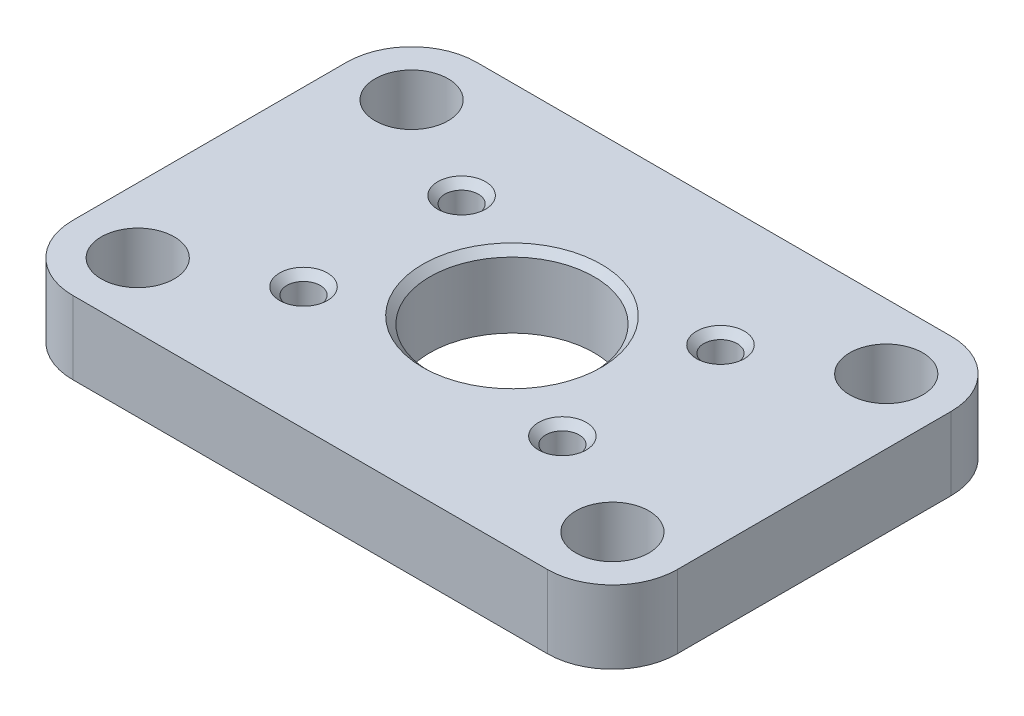
ISO-10303-21;
HEADER;
FILE_DESCRIPTION(('STEP AP214'),'2;1');
FILE_NAME('part.step','',(''),(''),'','','');
FILE_SCHEMA(('AUTOMOTIVE_DESIGN { 1 0 10303 214 1 1 1 1 }'));
ENDSEC;
DATA;
#1=APPLICATION_CONTEXT('core data for automotive mechanical design processes');
#2=APPLICATION_PROTOCOL_DEFINITION('international standard','automotive_design',2000,#1);
#3=PRODUCT_CONTEXT('',#1,'mechanical');
#4=PRODUCT('Part','Part','',(#3));
#5=PRODUCT_RELATED_PRODUCT_CATEGORY('part','',(#4));
#6=PRODUCT_DEFINITION_FORMATION('','',#4);
#7=PRODUCT_DEFINITION_CONTEXT('part definition',#1,'design');
#8=PRODUCT_DEFINITION('design','',#6,#7);
#9=PRODUCT_DEFINITION_SHAPE('','',#8);
#10=(LENGTH_UNIT() NAMED_UNIT(*) SI_UNIT(.MILLI.,.METRE.));
#11=(NAMED_UNIT(*) PLANE_ANGLE_UNIT() SI_UNIT($,.RADIAN.));
#12=(NAMED_UNIT(*) SI_UNIT($,.STERADIAN.) SOLID_ANGLE_UNIT());
#13=UNCERTAINTY_MEASURE_WITH_UNIT(LENGTH_MEASURE(1.E-05),#10,'distance_accuracy_value','');
#14=(GEOMETRIC_REPRESENTATION_CONTEXT(3) GLOBAL_UNCERTAINTY_ASSIGNED_CONTEXT((#13)) GLOBAL_UNIT_ASSIGNED_CONTEXT((#10,
#11,#12)) REPRESENTATION_CONTEXT('',''));
#15=CARTESIAN_POINT('',(0.,0.,0.));
#16=DIRECTION('',(0.,0.,1.));
#17=DIRECTION('',(1.,0.,0.));
#18=AXIS2_PLACEMENT_3D('',#15,#16,#17);
#19=CARTESIAN_POINT('',(16.51,5.08,9.525));
#20=DIRECTION('',(0.,1.,0.));
#21=DIRECTION('',(0.,0.,1.));
#22=AXIS2_PLACEMENT_3D('',#19,#20,#21);
#23=PLANE('',#22);
#24=CARTESIAN_POINT('',(0.,5.08,0.));
#25=DIRECTION('',(0.,1.,0.));
#26=DIRECTION('',(0.,0.,1.));
#27=AXIS2_PLACEMENT_3D('',#24,#25,#26);
#28=CIRCLE('',#27,6.215);
#29=CARTESIAN_POINT('',(0.,5.08,6.215));
#30=VERTEX_POINT('',#29);
#31=EDGE_CURVE('E187',#30,#30,#28,.F.);
#32=ORIENTED_EDGE('',*,*,#31,.T.);
#33=EDGE_LOOP('',(#32));
#34=FACE_BOUND('',#33,.T.);
#35=CARTESIAN_POINT('',(-9.0043,5.08,5.4991));
#36=DIRECTION('',(0.,1.,0.));
#37=DIRECTION('',(0.,0.,1.));
#38=AXIS2_PLACEMENT_3D('',#35,#36,#37);
#39=CIRCLE('',#38,1.66205000000001);
#40=CARTESIAN_POINT('',(-9.0043,5.08,7.16115));
#41=VERTEX_POINT('',#40);
#42=EDGE_CURVE('E184',#41,#41,#39,.F.);
#43=ORIENTED_EDGE('',*,*,#42,.T.);
#44=EDGE_LOOP('',(#43));
#45=FACE_BOUND('',#44,.T.);
#46=CARTESIAN_POINT('',(9.0043,5.08,5.4991));
#47=DIRECTION('',(0.,1.,0.));
#48=DIRECTION('',(0.,0.,1.));
#49=AXIS2_PLACEMENT_3D('',#46,#47,#48);
#50=CIRCLE('',#49,1.66205000000001);
#51=CARTESIAN_POINT('',(9.0043,5.08,7.16115));
#52=VERTEX_POINT('',#51);
#53=EDGE_CURVE('E181',#52,#52,#50,.F.);
#54=ORIENTED_EDGE('',*,*,#53,.T.);
#55=EDGE_LOOP('',(#54));
#56=FACE_BOUND('',#55,.T.);
#57=CARTESIAN_POINT('',(9.0043,5.08,-5.4991));
#58=DIRECTION('',(0.,1.,0.));
#59=DIRECTION('',(0.,0.,1.));
#60=AXIS2_PLACEMENT_3D('',#57,#58,#59);
#61=CIRCLE('',#60,1.66205000000001);
#62=CARTESIAN_POINT('',(9.0043,5.08,-3.83705));
#63=VERTEX_POINT('',#62);
#64=EDGE_CURVE('E178',#63,#63,#61,.F.);
#65=ORIENTED_EDGE('',*,*,#64,.T.);
#66=EDGE_LOOP('',(#65));
#67=FACE_BOUND('',#66,.T.);
#68=CARTESIAN_POINT('',(-9.0043,5.08,-5.4991));
#69=DIRECTION('',(0.,1.,0.));
#70=DIRECTION('',(0.,0.,1.));
#71=AXIS2_PLACEMENT_3D('',#68,#69,#70);
#72=CIRCLE('',#71,1.66205000000001);
#73=CARTESIAN_POINT('',(-9.0043,5.08,-3.83705));
#74=VERTEX_POINT('',#73);
#75=EDGE_CURVE('E175',#74,#74,#72,.F.);
#76=ORIENTED_EDGE('',*,*,#75,.T.);
#77=EDGE_LOOP('',(#76));
#78=FACE_BOUND('',#77,.T.);
#79=CARTESIAN_POINT('',(16.51,5.08,9.525));
#80=DIRECTION('',(0.,1.,0.));
#81=DIRECTION('',(0.,0.,1.));
#82=AXIS2_PLACEMENT_3D('',#79,#80,#81);
#83=CIRCLE('',#82,2.54);
#84=CARTESIAN_POINT('',(16.51,5.08,12.065));
#85=VERTEX_POINT('',#84);
#86=EDGE_CURVE('E310',#85,#85,#83,.T.);
#87=ORIENTED_EDGE('',*,*,#86,.F.);
#88=EDGE_LOOP('',(#87));
#89=FACE_BOUND('',#88,.T.);
#90=CARTESIAN_POINT('',(-16.51,5.08,9.525));
#91=DIRECTION('',(0.,1.,0.));
#92=DIRECTION('',(0.,0.,1.));
#93=AXIS2_PLACEMENT_3D('',#90,#91,#92);
#94=CIRCLE('',#93,2.54);
#95=CARTESIAN_POINT('',(-16.51,5.08,12.065));
#96=VERTEX_POINT('',#95);
#97=EDGE_CURVE('E146',#96,#96,#94,.T.);
#98=ORIENTED_EDGE('',*,*,#97,.F.);
#99=EDGE_LOOP('',(#98));
#100=FACE_BOUND('',#99,.T.);
#101=CARTESIAN_POINT('',(16.51,5.08,9.525));
#102=DIRECTION('',(0.,1.,0.));
#103=DIRECTION('',(0.,0.,1.));
#104=AXIS2_PLACEMENT_3D('',#101,#102,#103);
#105=CIRCLE('',#104,4.5212);
#106=CARTESIAN_POINT('',(16.51,5.08,14.0462));
#107=VERTEX_POINT('',#106);
#108=CARTESIAN_POINT('',(21.0312,5.08,9.525));
#109=VERTEX_POINT('',#108);
#110=EDGE_CURVE('E157',#107,#109,#105,.T.);
#111=ORIENTED_EDGE('',*,*,#110,.T.);
#112=DIRECTION('',(0.,0.,-1.));
#113=VECTOR('',#112,1.);
#114=CARTESIAN_POINT('',(21.0312,5.08,9.525));
#115=LINE('',#114,#113);
#116=CARTESIAN_POINT('',(21.0312,5.08,-9.525));
#117=VERTEX_POINT('',#116);
#118=EDGE_CURVE('E105',#109,#117,#115,.T.);
#119=ORIENTED_EDGE('',*,*,#118,.T.);
#120=CARTESIAN_POINT('',(16.51,5.08,-9.525));
#121=DIRECTION('',(0.,1.,0.));
#122=DIRECTION('',(0.,0.,-1.));
#123=AXIS2_PLACEMENT_3D('',#120,#121,#122);
#124=CIRCLE('',#123,4.5212);
#125=CARTESIAN_POINT('',(16.51,5.08,-14.0462));
#126=VERTEX_POINT('',#125);
#127=EDGE_CURVE('E328',#117,#126,#124,.T.);
#128=ORIENTED_EDGE('',*,*,#127,.T.);
#129=DIRECTION('',(-1.,0.,0.));
#130=VECTOR('',#129,1.);
#131=CARTESIAN_POINT('',(-16.51,5.08,-14.0462));
#132=LINE('',#131,#130);
#133=CARTESIAN_POINT('',(-16.51,5.08,-14.0462));
#134=VERTEX_POINT('',#133);
#135=EDGE_CURVE('E330',#126,#134,#132,.T.);
#136=ORIENTED_EDGE('',*,*,#135,.T.);
#137=CARTESIAN_POINT('',(-16.51,5.08,-9.52499999999999));
#138=DIRECTION('',(0.,1.,0.));
#139=DIRECTION('',(0.,0.,-1.));
#140=AXIS2_PLACEMENT_3D('',#137,#138,#139);
#141=CIRCLE('',#140,4.5212);
#142=CARTESIAN_POINT('',(-21.0312,5.08,-9.52499999999999));
#143=VERTEX_POINT('',#142);
#144=EDGE_CURVE('E124',#134,#143,#141,.T.);
#145=ORIENTED_EDGE('',*,*,#144,.T.);
#146=DIRECTION('',(0.,0.,1.));
#147=VECTOR('',#146,1.);
#148=CARTESIAN_POINT('',(-21.0312,5.08,9.525));
#149=LINE('',#148,#147);
#150=CARTESIAN_POINT('',(-21.0312,5.08,9.525));
#151=VERTEX_POINT('',#150);
#152=EDGE_CURVE('E118',#143,#151,#149,.T.);
#153=ORIENTED_EDGE('',*,*,#152,.T.);
#154=CARTESIAN_POINT('',(-16.51,5.08,9.525));
#155=DIRECTION('',(0.,1.,0.));
#156=DIRECTION('',(0.,0.,-1.));
#157=AXIS2_PLACEMENT_3D('',#154,#155,#156);
#158=CIRCLE('',#157,4.5212);
#159=CARTESIAN_POINT('',(-16.51,5.08,14.0462));
#160=VERTEX_POINT('',#159);
#161=EDGE_CURVE('E122',#151,#160,#158,.T.);
#162=ORIENTED_EDGE('',*,*,#161,.T.);
#163=DIRECTION('',(1.,0.,0.));
#164=VECTOR('',#163,1.);
#165=CARTESIAN_POINT('',(-16.51,5.08,14.0462));
#166=LINE('',#165,#164);
#167=EDGE_CURVE('E61',#160,#107,#166,.T.);
#168=ORIENTED_EDGE('',*,*,#167,.T.);
#169=EDGE_LOOP('',(#111,#119,#128,#136,#145,#153,#162,#168));
#170=FACE_BOUND('',#169,.T.);
#171=CARTESIAN_POINT('',(-16.51,5.08,-9.52499999999999));
#172=DIRECTION('',(0.,1.,0.));
#173=DIRECTION('',(0.,0.,1.));
#174=AXIS2_PLACEMENT_3D('',#171,#172,#173);
#175=CIRCLE('',#174,2.54);
#176=CARTESIAN_POINT('',(-16.51,5.08,-6.98499999999999));
#177=VERTEX_POINT('',#176);
#178=EDGE_CURVE('E316',#177,#177,#175,.T.);
#179=ORIENTED_EDGE('',*,*,#178,.F.);
#180=EDGE_LOOP('',(#179));
#181=FACE_BOUND('',#180,.T.);
#182=CARTESIAN_POINT('',(16.51,5.08,-9.525));
#183=DIRECTION('',(0.,1.,0.));
#184=DIRECTION('',(0.,0.,1.));
#185=AXIS2_PLACEMENT_3D('',#182,#183,#184);
#186=CIRCLE('',#185,2.54);
#187=CARTESIAN_POINT('',(16.51,5.08,-6.985));
#188=VERTEX_POINT('',#187);
#189=EDGE_CURVE('E304',#188,#188,#186,.T.);
#190=ORIENTED_EDGE('',*,*,#189,.F.);
#191=EDGE_LOOP('',(#190));
#192=FACE_BOUND('',#191,.T.);
#193=ADVANCED_FACE('F43',(#34,#45,#56,#67,#78,#89,#100,#170,#181,#192),#23,.T.);
#194=CARTESIAN_POINT('',(16.51,0.,9.525));
#195=DIRECTION('',(0.,1.,0.));
#196=DIRECTION('',(0.,0.,1.));
#197=AXIS2_PLACEMENT_3D('',#194,#195,#196);
#198=PLANE('',#197);
#199=CARTESIAN_POINT('',(0.,0.,0.));
#200=DIRECTION('',(0.,1.,0.));
#201=DIRECTION('',(0.,0.,1.));
#202=AXIS2_PLACEMENT_3D('',#199,#200,#201);
#203=CIRCLE('',#202,5.715);
#204=CARTESIAN_POINT('',(0.,0.,5.715));
#205=VERTEX_POINT('',#204);
#206=EDGE_CURVE('E291',#205,#205,#203,.T.);
#207=ORIENTED_EDGE('',*,*,#206,.T.);
#208=EDGE_LOOP('',(#207));
#209=FACE_BOUND('',#208,.T.);
#210=CARTESIAN_POINT('',(-9.0043,0.,5.4991));
#211=DIRECTION('',(0.,1.,0.));
#212=DIRECTION('',(0.,0.,1.));
#213=AXIS2_PLACEMENT_3D('',#210,#211,#212);
#214=CIRCLE('',#213,1.16205);
#215=CARTESIAN_POINT('',(-9.0043,0.,6.66115));
#216=VERTEX_POINT('',#215);
#217=EDGE_CURVE('E288',#216,#216,#214,.T.);
#218=ORIENTED_EDGE('',*,*,#217,.T.);
#219=EDGE_LOOP('',(#218));
#220=FACE_BOUND('',#219,.T.);
#221=CARTESIAN_POINT('',(9.0043,0.,5.4991));
#222=DIRECTION('',(0.,1.,0.));
#223=DIRECTION('',(0.,0.,1.));
#224=AXIS2_PLACEMENT_3D('',#221,#222,#223);
#225=CIRCLE('',#224,1.16205);
#226=CARTESIAN_POINT('',(9.0043,0.,6.66115));
#227=VERTEX_POINT('',#226);
#228=EDGE_CURVE('E290',#227,#227,#225,.T.);
#229=ORIENTED_EDGE('',*,*,#228,.T.);
#230=EDGE_LOOP('',(#229));
#231=FACE_BOUND('',#230,.T.);
#232=CARTESIAN_POINT('',(9.0043,0.,-5.4991));
#233=DIRECTION('',(0.,1.,0.));
#234=DIRECTION('',(0.,0.,1.));
#235=AXIS2_PLACEMENT_3D('',#232,#233,#234);
#236=CIRCLE('',#235,1.16205);
#237=CARTESIAN_POINT('',(9.0043,0.,-4.33705));
#238=VERTEX_POINT('',#237);
#239=EDGE_CURVE('E294',#238,#238,#236,.T.);
#240=ORIENTED_EDGE('',*,*,#239,.T.);
#241=EDGE_LOOP('',(#240));
#242=FACE_BOUND('',#241,.T.);
#243=CARTESIAN_POINT('',(-9.0043,0.,-5.4991));
#244=DIRECTION('',(0.,1.,0.));
#245=DIRECTION('',(0.,0.,1.));
#246=AXIS2_PLACEMENT_3D('',#243,#244,#245);
#247=CIRCLE('',#246,1.16205);
#248=CARTESIAN_POINT('',(-9.0043,0.,-4.33705));
#249=VERTEX_POINT('',#248);
#250=EDGE_CURVE('E300',#249,#249,#247,.T.);
#251=ORIENTED_EDGE('',*,*,#250,.T.);
#252=EDGE_LOOP('',(#251));
#253=FACE_BOUND('',#252,.T.);
#254=CARTESIAN_POINT('',(16.51,0.,9.525));
#255=DIRECTION('',(0.,1.,0.));
#256=DIRECTION('',(0.,0.,1.));
#257=AXIS2_PLACEMENT_3D('',#254,#255,#256);
#258=CIRCLE('',#257,4.5212);
#259=CARTESIAN_POINT('',(16.51,0.,14.0462));
#260=VERTEX_POINT('',#259);
#261=CARTESIAN_POINT('',(21.0312,0.,9.525));
#262=VERTEX_POINT('',#261);
#263=EDGE_CURVE('E142',#260,#262,#258,.T.);
#264=ORIENTED_EDGE('',*,*,#263,.F.);
#265=DIRECTION('',(1.,0.,0.));
#266=VECTOR('',#265,1.);
#267=CARTESIAN_POINT('',(-16.51,0.,14.0462));
#268=LINE('',#267,#266);
#269=CARTESIAN_POINT('',(-16.51,0.,14.0462));
#270=VERTEX_POINT('',#269);
#271=EDGE_CURVE('E96',#270,#260,#268,.T.);
#272=ORIENTED_EDGE('',*,*,#271,.F.);
#273=CARTESIAN_POINT('',(-16.51,0.,9.525));
#274=DIRECTION('',(0.,1.,0.));
#275=DIRECTION('',(0.,0.,-1.));
#276=AXIS2_PLACEMENT_3D('',#273,#274,#275);
#277=CIRCLE('',#276,4.5212);
#278=CARTESIAN_POINT('',(-21.0312,0.,9.525));
#279=VERTEX_POINT('',#278);
#280=EDGE_CURVE('E90',#279,#270,#277,.T.);
#281=ORIENTED_EDGE('',*,*,#280,.F.);
#282=DIRECTION('',(0.,0.,1.));
#283=VECTOR('',#282,1.);
#284=CARTESIAN_POINT('',(-21.0312,0.,9.525));
#285=LINE('',#284,#283);
#286=CARTESIAN_POINT('',(-21.0312,0.,-9.52499999999999));
#287=VERTEX_POINT('',#286);
#288=EDGE_CURVE('E132',#287,#279,#285,.T.);
#289=ORIENTED_EDGE('',*,*,#288,.F.);
#290=CARTESIAN_POINT('',(-16.51,0.,-9.52499999999999));
#291=DIRECTION('',(0.,1.,0.));
#292=DIRECTION('',(0.,0.,-1.));
#293=AXIS2_PLACEMENT_3D('',#290,#291,#292);
#294=CIRCLE('',#293,4.5212);
#295=CARTESIAN_POINT('',(-16.51,0.,-14.0462));
#296=VERTEX_POINT('',#295);
#297=EDGE_CURVE('E152',#296,#287,#294,.T.);
#298=ORIENTED_EDGE('',*,*,#297,.F.);
#299=DIRECTION('',(-1.,0.,0.));
#300=VECTOR('',#299,1.);
#301=CARTESIAN_POINT('',(-16.51,0.,-14.0462));
#302=LINE('',#301,#300);
#303=CARTESIAN_POINT('',(16.51,0.,-14.0462));
#304=VERTEX_POINT('',#303);
#305=EDGE_CURVE('E150',#304,#296,#302,.T.);
#306=ORIENTED_EDGE('',*,*,#305,.F.);
#307=CARTESIAN_POINT('',(16.51,0.,-9.525));
#308=DIRECTION('',(0.,1.,0.));
#309=DIRECTION('',(0.,0.,-1.));
#310=AXIS2_PLACEMENT_3D('',#307,#308,#309);
#311=CIRCLE('',#310,4.5212);
#312=CARTESIAN_POINT('',(21.0312,0.,-9.525));
#313=VERTEX_POINT('',#312);
#314=EDGE_CURVE('E148',#313,#304,#311,.T.);
#315=ORIENTED_EDGE('',*,*,#314,.F.);
#316=DIRECTION('',(0.,0.,-1.));
#317=VECTOR('',#316,1.);
#318=CARTESIAN_POINT('',(21.0312,0.,9.525));
#319=LINE('',#318,#317);
#320=EDGE_CURVE('E145',#262,#313,#319,.T.);
#321=ORIENTED_EDGE('',*,*,#320,.F.);
#322=EDGE_LOOP('',(#264,#272,#281,#289,#298,#306,#315,#321));
#323=FACE_BOUND('',#322,.T.);
#324=CARTESIAN_POINT('',(-16.51,0.,9.525));
#325=DIRECTION('',(0.,1.,0.));
#326=DIRECTION('',(0.,0.,1.));
#327=AXIS2_PLACEMENT_3D('',#324,#325,#326);
#328=CIRCLE('',#327,2.54);
#329=CARTESIAN_POINT('',(-16.51,0.,12.065));
#330=VERTEX_POINT('',#329);
#331=EDGE_CURVE('E319',#330,#330,#328,.T.);
#332=ORIENTED_EDGE('',*,*,#331,.T.);
#333=EDGE_LOOP('',(#332));
#334=FACE_BOUND('',#333,.T.);
#335=CARTESIAN_POINT('',(-16.51,0.,-9.52499999999999));
#336=DIRECTION('',(0.,1.,0.));
#337=DIRECTION('',(0.,0.,1.));
#338=AXIS2_PLACEMENT_3D('',#335,#336,#337);
#339=CIRCLE('',#338,2.54);
#340=CARTESIAN_POINT('',(-16.51,0.,-6.98499999999999));
#341=VERTEX_POINT('',#340);
#342=EDGE_CURVE('E313',#341,#341,#339,.T.);
#343=ORIENTED_EDGE('',*,*,#342,.T.);
#344=EDGE_LOOP('',(#343));
#345=FACE_BOUND('',#344,.T.);
#346=CARTESIAN_POINT('',(16.51,0.,9.525));
#347=DIRECTION('',(0.,1.,0.));
#348=DIRECTION('',(0.,0.,1.));
#349=AXIS2_PLACEMENT_3D('',#346,#347,#348);
#350=CIRCLE('',#349,2.54);
#351=CARTESIAN_POINT('',(16.51,0.,12.065));
#352=VERTEX_POINT('',#351);
#353=EDGE_CURVE('E307',#352,#352,#350,.T.);
#354=ORIENTED_EDGE('',*,*,#353,.T.);
#355=EDGE_LOOP('',(#354));
#356=FACE_BOUND('',#355,.T.);
#357=CARTESIAN_POINT('',(16.51,0.,-9.525));
#358=DIRECTION('',(0.,1.,0.));
#359=DIRECTION('',(0.,0.,1.));
#360=AXIS2_PLACEMENT_3D('',#357,#358,#359);
#361=CIRCLE('',#360,2.54);
#362=CARTESIAN_POINT('',(16.51,0.,-6.985));
#363=VERTEX_POINT('',#362);
#364=EDGE_CURVE('E303',#363,#363,#361,.T.);
#365=ORIENTED_EDGE('',*,*,#364,.T.);
#366=EDGE_LOOP('',(#365));
#367=FACE_BOUND('',#366,.T.);
#368=ADVANCED_FACE('F216',(#209,#220,#231,#242,#253,#323,#334,#345,#356,#367),#198,.F.);
#369=CARTESIAN_POINT('',(16.51,5.08,9.525));
#370=DIRECTION('',(0.,-1.,0.));
#371=DIRECTION('',(0.,0.,-1.));
#372=AXIS2_PLACEMENT_3D('',#369,#370,#371);
#373=CYLINDRICAL_SURFACE('',#372,4.5212);
#374=ORIENTED_EDGE('',*,*,#263,.T.);
#375=DIRECTION('',(0.,-1.,0.));
#376=VECTOR('',#375,1.);
#377=CARTESIAN_POINT('',(21.0312,5.08,9.525));
#378=LINE('',#377,#376);
#379=EDGE_CURVE('E170',#109,#262,#378,.T.);
#380=ORIENTED_EDGE('',*,*,#379,.F.);
#381=ORIENTED_EDGE('',*,*,#110,.F.);
#382=DIRECTION('',(0.,-1.,0.));
#383=VECTOR('',#382,1.);
#384=CARTESIAN_POINT('',(16.51,5.08,14.0462));
#385=LINE('',#384,#383);
#386=EDGE_CURVE('E138',#107,#260,#385,.T.);
#387=ORIENTED_EDGE('',*,*,#386,.T.);
#388=EDGE_LOOP('',(#374,#380,#381,#387));
#389=FACE_BOUND('',#388,.T.);
#390=ADVANCED_FACE('F222',(#389),#373,.T.);
#391=CARTESIAN_POINT('',(21.0312,5.08,9.525));
#392=DIRECTION('',(-1.,0.,0.));
#393=DIRECTION('',(0.,0.,1.));
#394=AXIS2_PLACEMENT_3D('',#391,#392,#393);
#395=PLANE('',#394);
#396=ORIENTED_EDGE('',*,*,#320,.T.);
#397=DIRECTION('',(0.,-1.,0.));
#398=VECTOR('',#397,1.);
#399=CARTESIAN_POINT('',(21.0312,5.08,-9.525));
#400=LINE('',#399,#398);
#401=EDGE_CURVE('E167',#117,#313,#400,.T.);
#402=ORIENTED_EDGE('',*,*,#401,.F.);
#403=ORIENTED_EDGE('',*,*,#118,.F.);
#404=ORIENTED_EDGE('',*,*,#379,.T.);
#405=EDGE_LOOP('',(#396,#402,#403,#404));
#406=FACE_BOUND('',#405,.T.);
#407=ADVANCED_FACE('F248',(#406),#395,.F.);
#408=CARTESIAN_POINT('',(16.51,5.08,-9.525));
#409=DIRECTION('',(0.,-1.,0.));
#410=DIRECTION('',(0.,0.,-1.));
#411=AXIS2_PLACEMENT_3D('',#408,#409,#410);
#412=CYLINDRICAL_SURFACE('',#411,4.5212);
#413=ORIENTED_EDGE('',*,*,#314,.T.);
#414=DIRECTION('',(0.,-1.,0.));
#415=VECTOR('',#414,1.);
#416=CARTESIAN_POINT('',(16.51,5.08,-14.0462));
#417=LINE('',#416,#415);
#418=EDGE_CURVE('E164',#126,#304,#417,.T.);
#419=ORIENTED_EDGE('',*,*,#418,.F.);
#420=ORIENTED_EDGE('',*,*,#127,.F.);
#421=ORIENTED_EDGE('',*,*,#401,.T.);
#422=EDGE_LOOP('',(#413,#419,#420,#421));
#423=FACE_BOUND('',#422,.T.);
#424=ADVANCED_FACE('F244',(#423),#412,.T.);
#425=CARTESIAN_POINT('',(-16.51,5.08,-14.0462));
#426=DIRECTION('',(0.,0.,1.));
#427=DIRECTION('',(1.,0.,0.));
#428=AXIS2_PLACEMENT_3D('',#425,#426,#427);
#429=PLANE('',#428);
#430=ORIENTED_EDGE('',*,*,#305,.T.);
#431=DIRECTION('',(0.,-1.,0.));
#432=VECTOR('',#431,1.);
#433=CARTESIAN_POINT('',(-16.51,5.08,-14.0462));
#434=LINE('',#433,#432);
#435=EDGE_CURVE('E161',#134,#296,#434,.T.);
#436=ORIENTED_EDGE('',*,*,#435,.F.);
#437=ORIENTED_EDGE('',*,*,#135,.F.);
#438=ORIENTED_EDGE('',*,*,#418,.T.);
#439=EDGE_LOOP('',(#430,#436,#437,#438));
#440=FACE_BOUND('',#439,.T.);
#441=ADVANCED_FACE('F240',(#440),#429,.F.);
#442=CARTESIAN_POINT('',(-16.51,5.08,-9.52499999999999));
#443=DIRECTION('',(0.,-1.,0.));
#444=DIRECTION('',(0.,0.,-1.));
#445=AXIS2_PLACEMENT_3D('',#442,#443,#444);
#446=CYLINDRICAL_SURFACE('',#445,4.5212);
#447=ORIENTED_EDGE('',*,*,#297,.T.);
#448=DIRECTION('',(0.,-1.,0.));
#449=VECTOR('',#448,1.);
#450=CARTESIAN_POINT('',(-21.0312,5.08,-9.52499999999999));
#451=LINE('',#450,#449);
#452=EDGE_CURVE('E133',#143,#287,#451,.T.);
#453=ORIENTED_EDGE('',*,*,#452,.F.);
#454=ORIENTED_EDGE('',*,*,#144,.F.);
#455=ORIENTED_EDGE('',*,*,#435,.T.);
#456=EDGE_LOOP('',(#447,#453,#454,#455));
#457=FACE_BOUND('',#456,.T.);
#458=ADVANCED_FACE('F237',(#457),#446,.T.);
#459=CARTESIAN_POINT('',(-21.0312,5.08,9.525));
#460=DIRECTION('',(1.,0.,0.));
#461=DIRECTION('',(0.,0.,-1.));
#462=AXIS2_PLACEMENT_3D('',#459,#460,#461);
#463=PLANE('',#462);
#464=ORIENTED_EDGE('',*,*,#288,.T.);
#465=DIRECTION('',(0.,-1.,0.));
#466=VECTOR('',#465,1.);
#467=CARTESIAN_POINT('',(-21.0312,5.08,9.525));
#468=LINE('',#467,#466);
#469=EDGE_CURVE('E129',#151,#279,#468,.T.);
#470=ORIENTED_EDGE('',*,*,#469,.F.);
#471=ORIENTED_EDGE('',*,*,#152,.F.);
#472=ORIENTED_EDGE('',*,*,#452,.T.);
#473=EDGE_LOOP('',(#464,#470,#471,#472));
#474=FACE_BOUND('',#473,.T.);
#475=ADVANCED_FACE('F130',(#474),#463,.F.);
#476=CARTESIAN_POINT('',(-16.51,5.08,9.525));
#477=DIRECTION('',(0.,-1.,0.));
#478=DIRECTION('',(0.,0.,-1.));
#479=AXIS2_PLACEMENT_3D('',#476,#477,#478);
#480=CYLINDRICAL_SURFACE('',#479,4.5212);
#481=ORIENTED_EDGE('',*,*,#280,.T.);
#482=DIRECTION('',(0.,-1.,0.));
#483=VECTOR('',#482,1.);
#484=CARTESIAN_POINT('',(-16.51,5.08,14.0462));
#485=LINE('',#484,#483);
#486=EDGE_CURVE('E134',#160,#270,#485,.T.);
#487=ORIENTED_EDGE('',*,*,#486,.F.);
#488=ORIENTED_EDGE('',*,*,#161,.F.);
#489=ORIENTED_EDGE('',*,*,#469,.T.);
#490=EDGE_LOOP('',(#481,#487,#488,#489));
#491=FACE_BOUND('',#490,.T.);
#492=ADVANCED_FACE('F136',(#491),#480,.T.);
#493=CARTESIAN_POINT('',(-16.51,5.08,14.0462));
#494=DIRECTION('',(0.,0.,-1.));
#495=DIRECTION('',(-1.,0.,0.));
#496=AXIS2_PLACEMENT_3D('',#493,#494,#495);
#497=PLANE('',#496);
#498=ORIENTED_EDGE('',*,*,#271,.T.);
#499=ORIENTED_EDGE('',*,*,#386,.F.);
#500=ORIENTED_EDGE('',*,*,#167,.F.);
#501=ORIENTED_EDGE('',*,*,#486,.T.);
#502=EDGE_LOOP('',(#498,#499,#500,#501));
#503=FACE_BOUND('',#502,.T.);
#504=ADVANCED_FACE('F230',(#503),#497,.F.);
#505=CARTESIAN_POINT('',(-16.51,5.08,9.525));
#506=DIRECTION('',(0.,-1.,0.));
#507=DIRECTION('',(0.,0.,-1.));
#508=AXIS2_PLACEMENT_3D('',#505,#506,#507);
#509=CYLINDRICAL_SURFACE('',#508,2.54);
#510=ORIENTED_EDGE('',*,*,#97,.T.);
#511=EDGE_LOOP('',(#510));
#512=FACE_BOUND('',#511,.T.);
#513=ORIENTED_EDGE('',*,*,#331,.F.);
#514=EDGE_LOOP('',(#513));
#515=FACE_BOUND('',#514,.T.);
#516=ADVANCED_FACE('F227',(#512,#515),#509,.F.);
#517=CARTESIAN_POINT('',(-16.51,5.08,-9.52499999999999));
#518=DIRECTION('',(0.,-1.,0.));
#519=DIRECTION('',(0.,0.,-1.));
#520=AXIS2_PLACEMENT_3D('',#517,#518,#519);
#521=CYLINDRICAL_SURFACE('',#520,2.54);
#522=ORIENTED_EDGE('',*,*,#178,.T.);
#523=EDGE_LOOP('',(#522));
#524=FACE_BOUND('',#523,.T.);
#525=ORIENTED_EDGE('',*,*,#342,.F.);
#526=EDGE_LOOP('',(#525));
#527=FACE_BOUND('',#526,.T.);
#528=ADVANCED_FACE('F363',(#524,#527),#521,.F.);
#529=CARTESIAN_POINT('',(16.51,5.08,9.525));
#530=DIRECTION('',(0.,-1.,0.));
#531=DIRECTION('',(0.,0.,-1.));
#532=AXIS2_PLACEMENT_3D('',#529,#530,#531);
#533=CYLINDRICAL_SURFACE('',#532,2.54);
#534=ORIENTED_EDGE('',*,*,#86,.T.);
#535=EDGE_LOOP('',(#534));
#536=FACE_BOUND('',#535,.T.);
#537=ORIENTED_EDGE('',*,*,#353,.F.);
#538=EDGE_LOOP('',(#537));
#539=FACE_BOUND('',#538,.T.);
#540=ADVANCED_FACE('F354',(#536,#539),#533,.F.);
#541=CARTESIAN_POINT('',(16.51,5.08,-9.525));
#542=DIRECTION('',(0.,-1.,0.));
#543=DIRECTION('',(0.,0.,-1.));
#544=AXIS2_PLACEMENT_3D('',#541,#542,#543);
#545=CYLINDRICAL_SURFACE('',#544,2.54);
#546=ORIENTED_EDGE('',*,*,#189,.T.);
#547=EDGE_LOOP('',(#546));
#548=FACE_BOUND('',#547,.T.);
#549=ORIENTED_EDGE('',*,*,#364,.F.);
#550=EDGE_LOOP('',(#549));
#551=FACE_BOUND('',#550,.T.);
#552=ADVANCED_FACE('F351',(#548,#551),#545,.F.);
#553=CARTESIAN_POINT('',(-9.0043,0.,-5.4991));
#554=DIRECTION('',(0.,1.,0.));
#555=DIRECTION('',(0.,0.,1.));
#556=AXIS2_PLACEMENT_3D('',#553,#554,#555);
#557=CYLINDRICAL_SURFACE('',#556,1.16205);
#558=CARTESIAN_POINT('',(-9.0043,4.58,-5.4991));
#559=DIRECTION('',(0.,1.,0.));
#560=DIRECTION('',(0.,0.,1.));
#561=AXIS2_PLACEMENT_3D('',#558,#559,#560);
#562=CIRCLE('',#561,1.16205);
#563=CARTESIAN_POINT('',(-9.0043,4.58,-4.33705));
#564=VERTEX_POINT('',#563);
#565=EDGE_CURVE('E11',#564,#564,#562,.T.);
#566=ORIENTED_EDGE('',*,*,#565,.T.);
#567=EDGE_LOOP('',(#566));
#568=FACE_BOUND('',#567,.T.);
#569=ORIENTED_EDGE('',*,*,#250,.F.);
#570=EDGE_LOOP('',(#569));
#571=FACE_BOUND('',#570,.T.);
#572=ADVANCED_FACE('F353',(#568,#571),#557,.F.);
#573=CARTESIAN_POINT('',(9.0043,0.,-5.4991));
#574=DIRECTION('',(0.,1.,0.));
#575=DIRECTION('',(0.,0.,1.));
#576=AXIS2_PLACEMENT_3D('',#573,#574,#575);
#577=CYLINDRICAL_SURFACE('',#576,1.16205);
#578=CARTESIAN_POINT('',(9.0043,4.58,-5.4991));
#579=DIRECTION('',(0.,1.,0.));
#580=DIRECTION('',(0.,0.,1.));
#581=AXIS2_PLACEMENT_3D('',#578,#579,#580);
#582=CIRCLE('',#581,1.16205);
#583=CARTESIAN_POINT('',(9.0043,4.58,-4.33705));
#584=VERTEX_POINT('',#583);
#585=EDGE_CURVE('E53',#584,#584,#582,.T.);
#586=ORIENTED_EDGE('',*,*,#585,.T.);
#587=EDGE_LOOP('',(#586));
#588=FACE_BOUND('',#587,.T.);
#589=ORIENTED_EDGE('',*,*,#239,.F.);
#590=EDGE_LOOP('',(#589));
#591=FACE_BOUND('',#590,.T.);
#592=ADVANCED_FACE('F198',(#588,#591),#577,.F.);
#593=CARTESIAN_POINT('',(9.0043,0.,5.4991));
#594=DIRECTION('',(0.,1.,0.));
#595=DIRECTION('',(0.,0.,1.));
#596=AXIS2_PLACEMENT_3D('',#593,#594,#595);
#597=CYLINDRICAL_SURFACE('',#596,1.16205);
#598=CARTESIAN_POINT('',(9.0043,4.58,5.4991));
#599=DIRECTION('',(0.,1.,0.));
#600=DIRECTION('',(0.,0.,1.));
#601=AXIS2_PLACEMENT_3D('',#598,#599,#600);
#602=CIRCLE('',#601,1.16205);
#603=CARTESIAN_POINT('',(9.0043,4.58,6.66115));
#604=VERTEX_POINT('',#603);
#605=EDGE_CURVE('E193',#604,#604,#602,.T.);
#606=ORIENTED_EDGE('',*,*,#605,.T.);
#607=EDGE_LOOP('',(#606));
#608=FACE_BOUND('',#607,.T.);
#609=ORIENTED_EDGE('',*,*,#228,.F.);
#610=EDGE_LOOP('',(#609));
#611=FACE_BOUND('',#610,.T.);
#612=ADVANCED_FACE('F284',(#608,#611),#597,.F.);
#613=CARTESIAN_POINT('',(-9.0043,0.,5.4991));
#614=DIRECTION('',(0.,1.,0.));
#615=DIRECTION('',(0.,0.,1.));
#616=AXIS2_PLACEMENT_3D('',#613,#614,#615);
#617=CYLINDRICAL_SURFACE('',#616,1.16205);
#618=CARTESIAN_POINT('',(-9.0043,4.58,5.4991));
#619=DIRECTION('',(0.,1.,0.));
#620=DIRECTION('',(0.,0.,1.));
#621=AXIS2_PLACEMENT_3D('',#618,#619,#620);
#622=CIRCLE('',#621,1.16205);
#623=CARTESIAN_POINT('',(-9.0043,4.58,6.66115));
#624=VERTEX_POINT('',#623);
#625=EDGE_CURVE('E190',#624,#624,#622,.T.);
#626=ORIENTED_EDGE('',*,*,#625,.T.);
#627=EDGE_LOOP('',(#626));
#628=FACE_BOUND('',#627,.T.);
#629=ORIENTED_EDGE('',*,*,#217,.F.);
#630=EDGE_LOOP('',(#629));
#631=FACE_BOUND('',#630,.T.);
#632=ADVANCED_FACE('F281',(#628,#631),#617,.F.);
#633=CARTESIAN_POINT('',(0.,0.,0.));
#634=DIRECTION('',(0.,1.,0.));
#635=DIRECTION('',(0.,0.,1.));
#636=AXIS2_PLACEMENT_3D('',#633,#634,#635);
#637=CYLINDRICAL_SURFACE('',#636,5.715);
#638=CARTESIAN_POINT('',(0.,4.58,0.));
#639=DIRECTION('',(0.,1.,0.));
#640=DIRECTION('',(0.,0.,1.));
#641=AXIS2_PLACEMENT_3D('',#638,#639,#640);
#642=CIRCLE('',#641,5.715);
#643=CARTESIAN_POINT('',(0.,4.58,5.715));
#644=VERTEX_POINT('',#643);
#645=EDGE_CURVE('E172',#644,#644,#642,.T.);
#646=ORIENTED_EDGE('',*,*,#645,.T.);
#647=EDGE_LOOP('',(#646));
#648=FACE_BOUND('',#647,.T.);
#649=ORIENTED_EDGE('',*,*,#206,.F.);
#650=EDGE_LOOP('',(#649));
#651=FACE_BOUND('',#650,.T.);
#652=ADVANCED_FACE('F262',(#648,#651),#637,.F.);
#653=CARTESIAN_POINT('',(0.,4.58,0.));
#654=DIRECTION('',(0.,1.,0.));
#655=DIRECTION('',(0.,0.,1.));
#656=AXIS2_PLACEMENT_3D('',#653,#654,#655);
#657=CONICAL_SURFACE('',#656,5.715,0.78539816339745);
#658=ORIENTED_EDGE('',*,*,#31,.F.);
#659=EDGE_LOOP('',(#658));
#660=FACE_BOUND('',#659,.T.);
#661=ORIENTED_EDGE('',*,*,#645,.F.);
#662=EDGE_LOOP('',(#661));
#663=FACE_BOUND('',#662,.T.);
#664=ADVANCED_FACE('F256',(#660,#663),#657,.F.);
#665=CARTESIAN_POINT('',(-9.0043,4.58,5.4991));
#666=DIRECTION('',(0.,1.,0.));
#667=DIRECTION('',(0.,0.,1.));
#668=AXIS2_PLACEMENT_3D('',#665,#666,#667);
#669=CONICAL_SURFACE('',#668,1.16205,0.785398163397451);
#670=ORIENTED_EDGE('',*,*,#42,.F.);
#671=EDGE_LOOP('',(#670));
#672=FACE_BOUND('',#671,.T.);
#673=ORIENTED_EDGE('',*,*,#625,.F.);
#674=EDGE_LOOP('',(#673));
#675=FACE_BOUND('',#674,.T.);
#676=ADVANCED_FACE('F210',(#672,#675),#669,.F.);
#677=CARTESIAN_POINT('',(9.0043,4.58,5.4991));
#678=DIRECTION('',(0.,1.,0.));
#679=DIRECTION('',(0.,0.,1.));
#680=AXIS2_PLACEMENT_3D('',#677,#678,#679);
#681=CONICAL_SURFACE('',#680,1.16205,0.785398163397451);
#682=ORIENTED_EDGE('',*,*,#53,.F.);
#683=EDGE_LOOP('',(#682));
#684=FACE_BOUND('',#683,.T.);
#685=ORIENTED_EDGE('',*,*,#605,.F.);
#686=EDGE_LOOP('',(#685));
#687=FACE_BOUND('',#686,.T.);
#688=ADVANCED_FACE('F203',(#684,#687),#681,.F.);
#689=CARTESIAN_POINT('',(9.0043,4.58,-5.4991));
#690=DIRECTION('',(0.,1.,0.));
#691=DIRECTION('',(0.,0.,1.));
#692=AXIS2_PLACEMENT_3D('',#689,#690,#691);
#693=CONICAL_SURFACE('',#692,1.16205,0.785398163397451);
#694=ORIENTED_EDGE('',*,*,#64,.F.);
#695=EDGE_LOOP('',(#694));
#696=FACE_BOUND('',#695,.T.);
#697=ORIENTED_EDGE('',*,*,#585,.F.);
#698=EDGE_LOOP('',(#697));
#699=FACE_BOUND('',#698,.T.);
#700=ADVANCED_FACE('F201',(#696,#699),#693,.F.);
#701=CARTESIAN_POINT('',(-9.0043,4.58,-5.4991));
#702=DIRECTION('',(0.,1.,0.));
#703=DIRECTION('',(0.,0.,1.));
#704=AXIS2_PLACEMENT_3D('',#701,#702,#703);
#705=CONICAL_SURFACE('',#704,1.16205,0.785398163397451);
#706=ORIENTED_EDGE('',*,*,#75,.F.);
#707=EDGE_LOOP('',(#706));
#708=FACE_BOUND('',#707,.T.);
#709=ORIENTED_EDGE('',*,*,#565,.F.);
#710=EDGE_LOOP('',(#709));
#711=FACE_BOUND('',#710,.T.);
#712=ADVANCED_FACE('F46',(#708,#711),#705,.F.);
#713=CLOSED_SHELL('',(#193,#368,#390,#407,#424,#441,#458,#475,#492,#504,#516,#528,#540,#552,
#572,#592,#612,#632,#652,#664,#676,#688,#700,#712));
#714=MANIFOLD_SOLID_BREP('B2',#713);
#715=ADVANCED_BREP_SHAPE_REPRESENTATION('',(#18,#714),#14);
#716=SHAPE_DEFINITION_REPRESENTATION(#9,#715);
ENDSEC;
END-ISO-10303-21;
